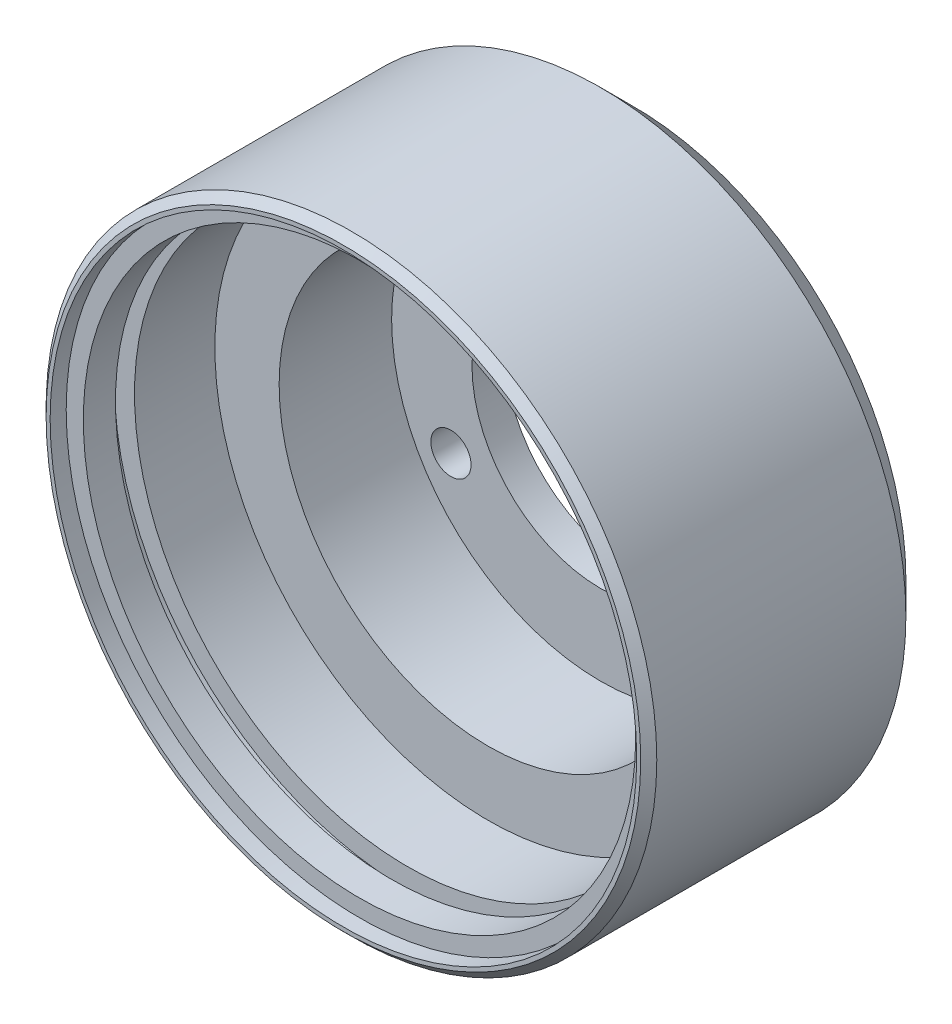
ISO-10303-21;
HEADER;
FILE_DESCRIPTION(('STEP AP214'),'2;1');
FILE_NAME('part.step','',(''),(''),'','','');
FILE_SCHEMA(('AUTOMOTIVE_DESIGN { 1 0 10303 214 1 1 1 1 }'));
ENDSEC;
DATA;
#1=APPLICATION_CONTEXT('core data for automotive mechanical design processes');
#2=APPLICATION_PROTOCOL_DEFINITION('international standard','automotive_design',2000,#1);
#3=PRODUCT_CONTEXT('',#1,'mechanical');
#4=PRODUCT('Part','Part','',(#3));
#5=PRODUCT_RELATED_PRODUCT_CATEGORY('part','',(#4));
#6=PRODUCT_DEFINITION_FORMATION('','',#4);
#7=PRODUCT_DEFINITION_CONTEXT('part definition',#1,'design');
#8=PRODUCT_DEFINITION('design','',#6,#7);
#9=PRODUCT_DEFINITION_SHAPE('','',#8);
#10=(LENGTH_UNIT() NAMED_UNIT(*) SI_UNIT(.MILLI.,.METRE.));
#11=(NAMED_UNIT(*) PLANE_ANGLE_UNIT() SI_UNIT($,.RADIAN.));
#12=(NAMED_UNIT(*) SI_UNIT($,.STERADIAN.) SOLID_ANGLE_UNIT());
#13=UNCERTAINTY_MEASURE_WITH_UNIT(LENGTH_MEASURE(1.E-05),#10,'distance_accuracy_value','');
#14=(GEOMETRIC_REPRESENTATION_CONTEXT(3) GLOBAL_UNCERTAINTY_ASSIGNED_CONTEXT((#13)) GLOBAL_UNIT_ASSIGNED_CONTEXT((#10,
#11,#12)) REPRESENTATION_CONTEXT('',''));
#15=CARTESIAN_POINT('',(0.,0.,0.));
#16=DIRECTION('',(0.,0.,1.));
#17=DIRECTION('',(1.,0.,0.));
#18=AXIS2_PLACEMENT_3D('',#15,#16,#17);
#19=CARTESIAN_POINT('',(0.,0.,18.));
#20=DIRECTION('',(0.,0.,-1.));
#21=DIRECTION('',(-1.,0.,0.));
#22=AXIS2_PLACEMENT_3D('',#19,#20,#21);
#23=CYLINDRICAL_SURFACE('',#22,17.);
#24=CARTESIAN_POINT('',(0.,0.,9.));
#25=DIRECTION('',(0.,0.,1.));
#26=DIRECTION('',(1.,0.,0.));
#27=AXIS2_PLACEMENT_3D('',#24,#25,#26);
#28=CIRCLE('',#27,17.);
#29=CARTESIAN_POINT('',(17.,0.,9.));
#30=VERTEX_POINT('',#29);
#31=EDGE_CURVE('E60',#30,#30,#28,.T.);
#32=ORIENTED_EDGE('',*,*,#31,.F.);
#33=EDGE_LOOP('',(#32));
#34=FACE_BOUND('',#33,.T.);
#35=CARTESIAN_POINT('',(0.,0.,14.));
#36=DIRECTION('',(0.,0.,1.));
#37=DIRECTION('',(1.,0.,0.));
#38=AXIS2_PLACEMENT_3D('',#35,#36,#37);
#39=CIRCLE('',#38,17.);
#40=CARTESIAN_POINT('',(17.,0.,14.));
#41=VERTEX_POINT('',#40);
#42=EDGE_CURVE('E55',#41,#41,#39,.T.);
#43=ORIENTED_EDGE('',*,*,#42,.T.);
#44=EDGE_LOOP('',(#43));
#45=FACE_BOUND('',#44,.T.);
#46=ADVANCED_FACE('F31',(#34,#45),#23,.F.);
#47=CARTESIAN_POINT('',(0.,0.,-36.7695526217005));
#48=DIRECTION('',(0.,0.,1.));
#49=DIRECTION('',(1.,0.,0.));
#50=AXIS2_PLACEMENT_3D('',#47,#48,#49);
#51=CYLINDRICAL_SURFACE('',#50,13.);
#52=CARTESIAN_POINT('',(0.,0.,2.));
#53=DIRECTION('',(0.,0.,1.));
#54=DIRECTION('',(1.,0.,0.));
#55=AXIS2_PLACEMENT_3D('',#52,#53,#54);
#56=CIRCLE('',#55,13.);
#57=CARTESIAN_POINT('',(13.,0.,2.));
#58=VERTEX_POINT('',#57);
#59=EDGE_CURVE('E71',#58,#58,#56,.T.);
#60=ORIENTED_EDGE('',*,*,#59,.F.);
#61=EDGE_LOOP('',(#60));
#62=FACE_BOUND('',#61,.T.);
#63=CARTESIAN_POINT('',(0.,0.,8.99999999999999));
#64=DIRECTION('',(0.,0.,1.));
#65=DIRECTION('',(1.,0.,0.));
#66=AXIS2_PLACEMENT_3D('',#63,#64,#65);
#67=CIRCLE('',#66,13.);
#68=CARTESIAN_POINT('',(13.,0.,8.99999999999999));
#69=VERTEX_POINT('',#68);
#70=EDGE_CURVE('E63',#69,#69,#67,.F.);
#71=ORIENTED_EDGE('',*,*,#70,.F.);
#72=EDGE_LOOP('',(#71));
#73=FACE_BOUND('',#72,.T.);
#74=ADVANCED_FACE('F125',(#62,#73),#51,.F.);
#75=CARTESIAN_POINT('',(0.,0.,17.));
#76=DIRECTION('',(0.,0.,1.));
#77=DIRECTION('',(1.,0.,0.));
#78=AXIS2_PLACEMENT_3D('',#75,#76,#77);
#79=PLANE('',#78);
#80=CARTESIAN_POINT('',(0.,0.,17.));
#81=DIRECTION('',(0.,0.,1.));
#82=DIRECTION('',(1.,0.,0.));
#83=AXIS2_PLACEMENT_3D('',#80,#81,#82);
#84=CIRCLE('',#83,17.185);
#85=CARTESIAN_POINT('',(17.185,0.,17.));
#86=VERTEX_POINT('',#85);
#87=EDGE_CURVE('E57',#86,#86,#84,.T.);
#88=ORIENTED_EDGE('',*,*,#87,.F.);
#89=EDGE_LOOP('',(#88));
#90=FACE_BOUND('',#89,.T.);
#91=CARTESIAN_POINT('',(0.,0.,17.));
#92=DIRECTION('',(0.,0.,1.));
#93=DIRECTION('',(1.,0.,0.));
#94=AXIS2_PLACEMENT_3D('',#91,#92,#93);
#95=CIRCLE('',#94,18.25);
#96=CARTESIAN_POINT('',(18.25,0.,17.));
#97=VERTEX_POINT('',#96);
#98=EDGE_CURVE('E93',#97,#97,#95,.T.);
#99=ORIENTED_EDGE('',*,*,#98,.T.);
#100=EDGE_LOOP('',(#99));
#101=FACE_BOUND('',#100,.T.);
#102=ADVANCED_FACE('F131',(#90,#101),#79,.T.);
#103=CARTESIAN_POINT('',(0.,0.,18.));
#104=DIRECTION('',(0.,0.,-1.));
#105=DIRECTION('',(-1.,0.,0.));
#106=AXIS2_PLACEMENT_3D('',#103,#104,#105);
#107=CYLINDRICAL_SURFACE('',#106,8.);
#108=CARTESIAN_POINT('',(0.,0.,0.));
#109=DIRECTION('',(0.,0.,-1.));
#110=DIRECTION('',(-1.,0.,0.));
#111=AXIS2_PLACEMENT_3D('',#108,#109,#110);
#112=CIRCLE('',#111,8.);
#113=CARTESIAN_POINT('',(-8.,0.,0.));
#114=VERTEX_POINT('',#113);
#115=EDGE_CURVE('E51',#114,#114,#112,.T.);
#116=ORIENTED_EDGE('',*,*,#115,.T.);
#117=EDGE_LOOP('',(#116));
#118=FACE_BOUND('',#117,.T.);
#119=CARTESIAN_POINT('',(0.,0.,2.));
#120=DIRECTION('',(0.,0.,1.));
#121=DIRECTION('',(1.,0.,0.));
#122=AXIS2_PLACEMENT_3D('',#119,#120,#121);
#123=CIRCLE('',#122,8.);
#124=CARTESIAN_POINT('',(8.,0.,2.));
#125=VERTEX_POINT('',#124);
#126=EDGE_CURVE('E83',#125,#125,#123,.F.);
#127=ORIENTED_EDGE('',*,*,#126,.F.);
#128=EDGE_LOOP('',(#127));
#129=FACE_BOUND('',#128,.T.);
#130=ADVANCED_FACE('F142',(#118,#129),#107,.F.);
#131=CARTESIAN_POINT('',(0.,10.75,18.));
#132=DIRECTION('',(0.,0.,-1.));
#133=DIRECTION('',(-1.,0.,0.));
#134=AXIS2_PLACEMENT_3D('',#131,#132,#133);
#135=CYLINDRICAL_SURFACE('',#134,1.25);
#136=CARTESIAN_POINT('',(0.,10.75,0.));
#137=DIRECTION('',(0.,0.,-1.));
#138=DIRECTION('',(-1.,0.,0.));
#139=AXIS2_PLACEMENT_3D('',#136,#137,#138);
#140=CIRCLE('',#139,1.25);
#141=CARTESIAN_POINT('',(-1.25,10.75,0.));
#142=VERTEX_POINT('',#141);
#143=EDGE_CURVE('E74',#142,#142,#140,.T.);
#144=ORIENTED_EDGE('',*,*,#143,.T.);
#145=EDGE_LOOP('',(#144));
#146=FACE_BOUND('',#145,.T.);
#147=CARTESIAN_POINT('',(0.,10.75,2.));
#148=DIRECTION('',(0.,0.,1.));
#149=DIRECTION('',(1.,0.,0.));
#150=AXIS2_PLACEMENT_3D('',#147,#148,#149);
#151=CIRCLE('',#150,1.25);
#152=CARTESIAN_POINT('',(1.25,10.75,2.));
#153=VERTEX_POINT('',#152);
#154=EDGE_CURVE('E86',#153,#153,#151,.F.);
#155=ORIENTED_EDGE('',*,*,#154,.F.);
#156=EDGE_LOOP('',(#155));
#157=FACE_BOUND('',#156,.T.);
#158=ADVANCED_FACE('F160',(#146,#157),#135,.F.);
#159=CARTESIAN_POINT('',(9.30977309068269,-5.37500000000004,18.));
#160=DIRECTION('',(0.,0.,-1.));
#161=DIRECTION('',(-1.,0.,0.));
#162=AXIS2_PLACEMENT_3D('',#159,#160,#161);
#163=CYLINDRICAL_SURFACE('',#162,1.25);
#164=CARTESIAN_POINT('',(9.30977309068269,-5.37500000000004,0.));
#165=DIRECTION('',(0.,0.,-1.));
#166=DIRECTION('',(0.500000000000004,0.866025403784436,0.));
#167=AXIS2_PLACEMENT_3D('',#164,#165,#166);
#168=CIRCLE('',#167,1.25);
#169=CARTESIAN_POINT('',(9.93477309068269,-4.2924682452695,0.));
#170=VERTEX_POINT('',#169);
#171=EDGE_CURVE('E77',#170,#170,#168,.T.);
#172=ORIENTED_EDGE('',*,*,#171,.T.);
#173=EDGE_LOOP('',(#172));
#174=FACE_BOUND('',#173,.T.);
#175=CARTESIAN_POINT('',(9.30977309068269,-5.37500000000004,2.));
#176=DIRECTION('',(0.,0.,1.));
#177=DIRECTION('',(1.,0.,0.));
#178=AXIS2_PLACEMENT_3D('',#175,#176,#177);
#179=CIRCLE('',#178,1.25);
#180=CARTESIAN_POINT('',(10.5597730906827,-5.37500000000004,2.));
#181=VERTEX_POINT('',#180);
#182=EDGE_CURVE('E70',#181,#181,#179,.F.);
#183=ORIENTED_EDGE('',*,*,#182,.F.);
#184=EDGE_LOOP('',(#183));
#185=FACE_BOUND('',#184,.T.);
#186=ADVANCED_FACE('F156',(#174,#185),#163,.F.);
#187=CARTESIAN_POINT('',(-9.30977309068276,-5.37499999999991,18.));
#188=DIRECTION('',(0.,0.,-1.));
#189=DIRECTION('',(-1.,0.,0.));
#190=AXIS2_PLACEMENT_3D('',#187,#188,#189);
#191=CYLINDRICAL_SURFACE('',#190,1.25);
#192=CARTESIAN_POINT('',(-9.30977309068276,-5.37499999999991,0.));
#193=DIRECTION('',(0.,0.,-1.));
#194=DIRECTION('',(0.499999999999992,-0.866025403784443,0.));
#195=AXIS2_PLACEMENT_3D('',#192,#193,#194);
#196=CIRCLE('',#195,1.25);
#197=CARTESIAN_POINT('',(-8.68477309068277,-6.45753175473047,0.));
#198=VERTEX_POINT('',#197);
#199=EDGE_CURVE('E80',#198,#198,#196,.T.);
#200=ORIENTED_EDGE('',*,*,#199,.T.);
#201=EDGE_LOOP('',(#200));
#202=FACE_BOUND('',#201,.T.);
#203=CARTESIAN_POINT('',(-9.30977309068276,-5.37499999999991,2.));
#204=DIRECTION('',(0.,0.,1.));
#205=DIRECTION('',(1.,0.,0.));
#206=AXIS2_PLACEMENT_3D('',#203,#204,#205);
#207=CIRCLE('',#206,1.25);
#208=CARTESIAN_POINT('',(-8.05977309068276,-5.37499999999991,2.));
#209=VERTEX_POINT('',#208);
#210=EDGE_CURVE('E67',#209,#209,#207,.F.);
#211=ORIENTED_EDGE('',*,*,#210,.F.);
#212=EDGE_LOOP('',(#211));
#213=FACE_BOUND('',#212,.T.);
#214=ADVANCED_FACE('F153',(#202,#213),#191,.F.);
#215=CARTESIAN_POINT('',(0.,0.,18.));
#216=DIRECTION('',(0.,0.,-1.));
#217=DIRECTION('',(-1.,0.,0.));
#218=AXIS2_PLACEMENT_3D('',#215,#216,#217);
#219=CYLINDRICAL_SURFACE('',#218,19.);
#220=CARTESIAN_POINT('',(0.,0.,17.5));
#221=DIRECTION('',(0.,0.,1.));
#222=DIRECTION('',(1.,0.,0.));
#223=AXIS2_PLACEMENT_3D('',#220,#221,#222);
#224=CIRCLE('',#223,19.);
#225=CARTESIAN_POINT('',(19.,0.,17.5));
#226=VERTEX_POINT('',#225);
#227=EDGE_CURVE('E10',#226,#226,#224,.F.);
#228=ORIENTED_EDGE('',*,*,#227,.T.);
#229=EDGE_LOOP('',(#228));
#230=FACE_BOUND('',#229,.T.);
#231=CARTESIAN_POINT('',(0.,0.,2.));
#232=DIRECTION('',(0.,0.,1.));
#233=DIRECTION('',(1.,0.,0.));
#234=AXIS2_PLACEMENT_3D('',#231,#232,#233);
#235=CIRCLE('',#234,19.);
#236=CARTESIAN_POINT('',(19.,0.,2.));
#237=VERTEX_POINT('',#236);
#238=EDGE_CURVE('E46',#237,#237,#235,.T.);
#239=ORIENTED_EDGE('',*,*,#238,.T.);
#240=EDGE_LOOP('',(#239));
#241=FACE_BOUND('',#240,.T.);
#242=ADVANCED_FACE('F33',(#230,#241),#219,.T.);
#243=CARTESIAN_POINT('',(0.,0.,18.));
#244=DIRECTION('',(0.,0.,1.));
#245=DIRECTION('',(1.,0.,0.));
#246=AXIS2_PLACEMENT_3D('',#243,#244,#245);
#247=PLANE('',#246);
#248=CARTESIAN_POINT('',(0.,0.,18.));
#249=DIRECTION('',(0.,0.,1.));
#250=DIRECTION('',(1.,0.,0.));
#251=AXIS2_PLACEMENT_3D('',#248,#249,#250);
#252=CIRCLE('',#251,18.5);
#253=CARTESIAN_POINT('',(18.5,0.,18.));
#254=VERTEX_POINT('',#253);
#255=EDGE_CURVE('E38',#254,#254,#252,.T.);
#256=ORIENTED_EDGE('',*,*,#255,.T.);
#257=EDGE_LOOP('',(#256));
#258=FACE_BOUND('',#257,.T.);
#259=CARTESIAN_POINT('',(0.,0.,18.));
#260=DIRECTION('',(0.,0.,1.));
#261=DIRECTION('',(1.,0.,0.));
#262=AXIS2_PLACEMENT_3D('',#259,#260,#261);
#263=CIRCLE('',#262,18.25);
#264=CARTESIAN_POINT('',(18.25,0.,18.));
#265=VERTEX_POINT('',#264);
#266=EDGE_CURVE('E66',#265,#265,#263,.T.);
#267=ORIENTED_EDGE('',*,*,#266,.F.);
#268=EDGE_LOOP('',(#267));
#269=FACE_BOUND('',#268,.T.);
#270=ADVANCED_FACE('F169',(#258,#269),#247,.T.);
#271=CARTESIAN_POINT('',(0.,0.,0.));
#272=DIRECTION('',(0.,0.,1.));
#273=DIRECTION('',(1.,0.,0.));
#274=AXIS2_PLACEMENT_3D('',#271,#272,#273);
#275=PLANE('',#274);
#276=CARTESIAN_POINT('',(0.,0.,0.));
#277=DIRECTION('',(0.,0.,1.));
#278=DIRECTION('',(1.,0.,0.));
#279=AXIS2_PLACEMENT_3D('',#276,#277,#278);
#280=CIRCLE('',#279,17.);
#281=CARTESIAN_POINT('',(17.,0.,0.));
#282=VERTEX_POINT('',#281);
#283=EDGE_CURVE('E42',#282,#282,#280,.F.);
#284=ORIENTED_EDGE('',*,*,#283,.T.);
#285=EDGE_LOOP('',(#284));
#286=FACE_BOUND('',#285,.T.);
#287=ORIENTED_EDGE('',*,*,#199,.F.);
#288=EDGE_LOOP('',(#287));
#289=FACE_BOUND('',#288,.T.);
#290=ORIENTED_EDGE('',*,*,#171,.F.);
#291=EDGE_LOOP('',(#290));
#292=FACE_BOUND('',#291,.T.);
#293=ORIENTED_EDGE('',*,*,#143,.F.);
#294=EDGE_LOOP('',(#293));
#295=FACE_BOUND('',#294,.T.);
#296=ORIENTED_EDGE('',*,*,#115,.F.);
#297=EDGE_LOOP('',(#296));
#298=FACE_BOUND('',#297,.T.);
#299=ADVANCED_FACE('F151',(#286,#289,#292,#295,#298),#275,.F.);
#300=CARTESIAN_POINT('',(0.,0.,2.));
#301=DIRECTION('',(0.,0.,1.));
#302=DIRECTION('',(1.,0.,0.));
#303=AXIS2_PLACEMENT_3D('',#300,#301,#302);
#304=PLANE('',#303);
#305=ORIENTED_EDGE('',*,*,#154,.T.);
#306=EDGE_LOOP('',(#305));
#307=FACE_BOUND('',#306,.T.);
#308=ORIENTED_EDGE('',*,*,#210,.T.);
#309=EDGE_LOOP('',(#308));
#310=FACE_BOUND('',#309,.T.);
#311=ORIENTED_EDGE('',*,*,#59,.T.);
#312=EDGE_LOOP('',(#311));
#313=FACE_BOUND('',#312,.T.);
#314=ORIENTED_EDGE('',*,*,#182,.T.);
#315=EDGE_LOOP('',(#314));
#316=FACE_BOUND('',#315,.T.);
#317=ORIENTED_EDGE('',*,*,#126,.T.);
#318=EDGE_LOOP('',(#317));
#319=FACE_BOUND('',#318,.T.);
#320=ADVANCED_FACE('F147',(#307,#310,#313,#316,#319),#304,.T.);
#321=CARTESIAN_POINT('',(0.,0.,17.));
#322=DIRECTION('',(0.,0.,1.));
#323=DIRECTION('',(1.,0.,0.));
#324=AXIS2_PLACEMENT_3D('',#321,#322,#323);
#325=CYLINDRICAL_SURFACE('',#324,18.25);
#326=ORIENTED_EDGE('',*,*,#98,.F.);
#327=EDGE_LOOP('',(#326));
#328=FACE_BOUND('',#327,.T.);
#329=ORIENTED_EDGE('',*,*,#266,.T.);
#330=EDGE_LOOP('',(#329));
#331=FACE_BOUND('',#330,.T.);
#332=ADVANCED_FACE('F144',(#328,#331),#325,.F.);
#333=CARTESIAN_POINT('',(0.,0.,9.));
#334=DIRECTION('',(0.,0.,1.));
#335=DIRECTION('',(1.,0.,0.));
#336=AXIS2_PLACEMENT_3D('',#333,#334,#335);
#337=PLANE('',#336);
#338=ORIENTED_EDGE('',*,*,#31,.T.);
#339=EDGE_LOOP('',(#338));
#340=FACE_BOUND('',#339,.T.);
#341=ORIENTED_EDGE('',*,*,#70,.T.);
#342=EDGE_LOOP('',(#341));
#343=FACE_BOUND('',#342,.T.);
#344=ADVANCED_FACE('F138',(#340,#343),#337,.T.);
#345=CARTESIAN_POINT('',(0.,0.,14.));
#346=DIRECTION('',(0.,0.,1.));
#347=DIRECTION('',(1.,0.,0.));
#348=AXIS2_PLACEMENT_3D('',#345,#346,#347);
#349=CYLINDRICAL_SURFACE('',#348,17.185);
#350=CARTESIAN_POINT('',(0.,0.,15.));
#351=DIRECTION('',(0.,0.,1.));
#352=DIRECTION('',(1.,0.,0.));
#353=AXIS2_PLACEMENT_3D('',#350,#351,#352);
#354=CIRCLE('',#353,17.185);
#355=CARTESIAN_POINT('',(17.185,0.,15.));
#356=VERTEX_POINT('',#355);
#357=EDGE_CURVE('E52',#356,#356,#354,.F.);
#358=ORIENTED_EDGE('',*,*,#357,.T.);
#359=EDGE_LOOP('',(#358));
#360=FACE_BOUND('',#359,.T.);
#361=ORIENTED_EDGE('',*,*,#87,.T.);
#362=EDGE_LOOP('',(#361));
#363=FACE_BOUND('',#362,.T.);
#364=ADVANCED_FACE('F221',(#360,#363),#349,.F.);
#365=CARTESIAN_POINT('',(0.,0.,14.));
#366=DIRECTION('',(0.,0.,1.));
#367=DIRECTION('',(1.,0.,0.));
#368=AXIS2_PLACEMENT_3D('',#365,#366,#367);
#369=PLANE('',#368);
#370=ORIENTED_EDGE('',*,*,#42,.F.);
#371=EDGE_LOOP('',(#370));
#372=FACE_BOUND('',#371,.T.);
#373=CARTESIAN_POINT('',(0.,0.,14.));
#374=DIRECTION('',(0.,0.,1.));
#375=DIRECTION('',(1.,0.,0.));
#376=AXIS2_PLACEMENT_3D('',#373,#374,#375);
#377=CIRCLE('',#376,18.25);
#378=CARTESIAN_POINT('',(18.25,0.,14.));
#379=VERTEX_POINT('',#378);
#380=EDGE_CURVE('E102',#379,#379,#377,.T.);
#381=ORIENTED_EDGE('',*,*,#380,.T.);
#382=EDGE_LOOP('',(#381));
#383=FACE_BOUND('',#382,.T.);
#384=ADVANCED_FACE('F106',(#372,#383),#369,.T.);
#385=CARTESIAN_POINT('',(0.,0.,15.));
#386=DIRECTION('',(0.,0.,1.));
#387=DIRECTION('',(1.,0.,0.));
#388=AXIS2_PLACEMENT_3D('',#385,#386,#387);
#389=PLANE('',#388);
#390=CARTESIAN_POINT('',(0.,0.,15.));
#391=DIRECTION('',(0.,0.,1.));
#392=DIRECTION('',(1.,0.,0.));
#393=AXIS2_PLACEMENT_3D('',#390,#391,#392);
#394=CIRCLE('',#393,18.25);
#395=CARTESIAN_POINT('',(18.25,0.,15.));
#396=VERTEX_POINT('',#395);
#397=EDGE_CURVE('E56',#396,#396,#394,.T.);
#398=ORIENTED_EDGE('',*,*,#397,.F.);
#399=EDGE_LOOP('',(#398));
#400=FACE_BOUND('',#399,.T.);
#401=ORIENTED_EDGE('',*,*,#357,.F.);
#402=EDGE_LOOP('',(#401));
#403=FACE_BOUND('',#402,.T.);
#404=ADVANCED_FACE('F111',(#400,#403),#389,.F.);
#405=CARTESIAN_POINT('',(0.,0.,15.));
#406=DIRECTION('',(0.,0.,-1.));
#407=DIRECTION('',(-1.,0.,0.));
#408=AXIS2_PLACEMENT_3D('',#405,#406,#407);
#409=CYLINDRICAL_SURFACE('',#408,18.25);
#410=ORIENTED_EDGE('',*,*,#397,.T.);
#411=EDGE_LOOP('',(#410));
#412=FACE_BOUND('',#411,.T.);
#413=ORIENTED_EDGE('',*,*,#380,.F.);
#414=EDGE_LOOP('',(#413));
#415=FACE_BOUND('',#414,.T.);
#416=ADVANCED_FACE('F108',(#412,#415),#409,.F.);
#417=CARTESIAN_POINT('',(0.,0.,2.));
#418=DIRECTION('',(0.,0.,1.));
#419=DIRECTION('',(1.,0.,0.));
#420=AXIS2_PLACEMENT_3D('',#417,#418,#419);
#421=CONICAL_SURFACE('',#420,19.,0.785398163397449);
#422=ORIENTED_EDGE('',*,*,#283,.F.);
#423=EDGE_LOOP('',(#422));
#424=FACE_BOUND('',#423,.T.);
#425=ORIENTED_EDGE('',*,*,#238,.F.);
#426=EDGE_LOOP('',(#425));
#427=FACE_BOUND('',#426,.T.);
#428=ADVANCED_FACE('F110',(#424,#427),#421,.T.);
#429=CARTESIAN_POINT('',(0.,0.,18.));
#430=DIRECTION('',(0.,0.,-1.));
#431=DIRECTION('',(-1.,0.,0.));
#432=AXIS2_PLACEMENT_3D('',#429,#430,#431);
#433=CONICAL_SURFACE('',#432,18.5,0.785398163397452);
#434=ORIENTED_EDGE('',*,*,#227,.F.);
#435=EDGE_LOOP('',(#434));
#436=FACE_BOUND('',#435,.T.);
#437=ORIENTED_EDGE('',*,*,#255,.F.);
#438=EDGE_LOOP('',(#437));
#439=FACE_BOUND('',#438,.T.);
#440=ADVANCED_FACE('F118',(#436,#439),#433,.T.);
#441=CLOSED_SHELL('',(#46,#74,#102,#130,#158,#186,#214,#242,#270,#299,#320,#332,#344,#364,#384,
#404,#416,#428,#440));
#442=MANIFOLD_SOLID_BREP('B2',#441);
#443=ADVANCED_BREP_SHAPE_REPRESENTATION('',(#18,#442),#14);
#444=SHAPE_DEFINITION_REPRESENTATION(#9,#443);
ENDSEC;
END-ISO-10303-21;
